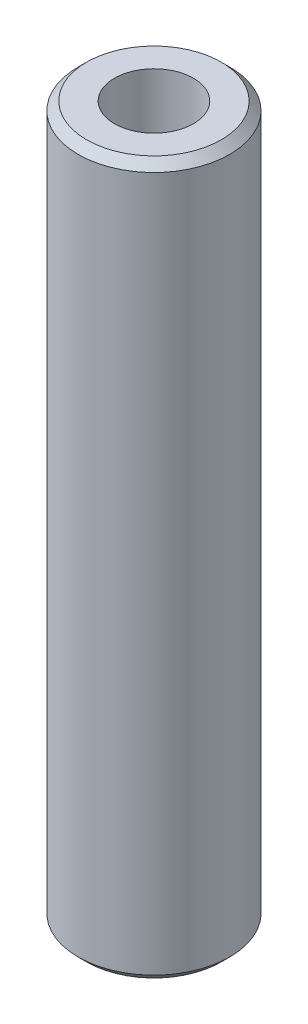
ISO-10303-21;
HEADER;
FILE_DESCRIPTION(('STEP AP214'),'2;1');
FILE_NAME('part.step','',(''),(''),'','','');
FILE_SCHEMA(('AUTOMOTIVE_DESIGN { 1 0 10303 214 1 1 1 1 }'));
ENDSEC;
DATA;
#1=APPLICATION_CONTEXT('core data for automotive mechanical design processes');
#2=APPLICATION_PROTOCOL_DEFINITION('international standard','automotive_design',2000,#1);
#3=PRODUCT_CONTEXT('',#1,'mechanical');
#4=PRODUCT('Part','Part','',(#3));
#5=PRODUCT_RELATED_PRODUCT_CATEGORY('part','',(#4));
#6=PRODUCT_DEFINITION_FORMATION('','',#4);
#7=PRODUCT_DEFINITION_CONTEXT('part definition',#1,'design');
#8=PRODUCT_DEFINITION('design','',#6,#7);
#9=PRODUCT_DEFINITION_SHAPE('','',#8);
#10=(LENGTH_UNIT() NAMED_UNIT(*) SI_UNIT(.MILLI.,.METRE.));
#11=(NAMED_UNIT(*) PLANE_ANGLE_UNIT() SI_UNIT($,.RADIAN.));
#12=(NAMED_UNIT(*) SI_UNIT($,.STERADIAN.) SOLID_ANGLE_UNIT());
#13=UNCERTAINTY_MEASURE_WITH_UNIT(LENGTH_MEASURE(1.E-05),#10,'distance_accuracy_value','');
#14=(GEOMETRIC_REPRESENTATION_CONTEXT(3) GLOBAL_UNCERTAINTY_ASSIGNED_CONTEXT((#13)) GLOBAL_UNIT_ASSIGNED_CONTEXT((#10,
#11,#12)) REPRESENTATION_CONTEXT('',''));
#15=CARTESIAN_POINT('',(0.,0.,0.));
#16=DIRECTION('',(0.,0.,1.));
#17=DIRECTION('',(1.,0.,0.));
#18=AXIS2_PLACEMENT_3D('',#15,#16,#17);
#19=CARTESIAN_POINT('',(0.,399.389153584108,0.));
#20=DIRECTION('',(0.,-1.,0.));
#21=DIRECTION('',(0.,0.,-1.));
#22=AXIS2_PLACEMENT_3D('',#19,#20,#21);
#23=CYLINDRICAL_SURFACE('',#22,42.5);
#24=CARTESIAN_POINT('',(0.,394.657051518276,0.));
#25=DIRECTION('',(0.,1.,0.));
#26=DIRECTION('',(0.,0.,1.));
#27=AXIS2_PLACEMENT_3D('',#24,#25,#26);
#28=CIRCLE('',#27,42.5);
#29=CARTESIAN_POINT('',(0.,394.657051518276,42.5));
#30=VERTEX_POINT('',#29);
#31=EDGE_CURVE('E50',#30,#30,#28,.F.);
#32=ORIENTED_EDGE('',*,*,#31,.T.);
#33=EDGE_LOOP('',(#32));
#34=FACE_BOUND('',#33,.T.);
#35=CARTESIAN_POINT('',(0.,4.73210206583213,0.));
#36=DIRECTION('',(0.,1.,0.));
#37=DIRECTION('',(0.,0.,1.));
#38=AXIS2_PLACEMENT_3D('',#35,#36,#37);
#39=CIRCLE('',#38,42.5);
#40=CARTESIAN_POINT('',(0.,4.73210206583213,42.5));
#41=VERTEX_POINT('',#40);
#42=EDGE_CURVE('E51',#41,#41,#39,.T.);
#43=ORIENTED_EDGE('',*,*,#42,.T.);
#44=EDGE_LOOP('',(#43));
#45=FACE_BOUND('',#44,.T.);
#46=ADVANCED_FACE('F39',(#34,#45),#23,.T.);
#47=CARTESIAN_POINT('',(0.,399.389153584108,0.));
#48=DIRECTION('',(0.,1.,0.));
#49=DIRECTION('',(0.,0.,1.));
#50=AXIS2_PLACEMENT_3D('',#47,#48,#49);
#51=PLANE('',#50);
#52=CARTESIAN_POINT('',(0.,399.389153584108,0.));
#53=DIRECTION('',(0.,1.,0.));
#54=DIRECTION('',(0.,0.,1.));
#55=AXIS2_PLACEMENT_3D('',#52,#53,#54);
#56=CIRCLE('',#55,37.7678979341677);
#57=CARTESIAN_POINT('',(0.,399.389153584108,37.7678979341677));
#58=VERTEX_POINT('',#57);
#59=EDGE_CURVE('E54',#58,#58,#56,.T.);
#60=ORIENTED_EDGE('',*,*,#59,.T.);
#61=EDGE_LOOP('',(#60));
#62=FACE_BOUND('',#61,.T.);
#63=CARTESIAN_POINT('',(0.,399.389153584108,0.));
#64=DIRECTION('',(0.,1.,0.));
#65=DIRECTION('',(0.,0.,1.));
#66=AXIS2_PLACEMENT_3D('',#63,#64,#65);
#67=CIRCLE('',#66,22.1499963429432);
#68=CARTESIAN_POINT('',(0.,399.389153584108,22.1499963429432));
#69=VERTEX_POINT('',#68);
#70=EDGE_CURVE('E58',#69,#69,#67,.T.);
#71=ORIENTED_EDGE('',*,*,#70,.F.);
#72=EDGE_LOOP('',(#71));
#73=FACE_BOUND('',#72,.T.);
#74=ADVANCED_FACE('F69',(#62,#73),#51,.T.);
#75=CARTESIAN_POINT('',(0.,0.,0.));
#76=DIRECTION('',(0.,1.,0.));
#77=DIRECTION('',(0.,0.,1.));
#78=AXIS2_PLACEMENT_3D('',#75,#76,#77);
#79=PLANE('',#78);
#80=CARTESIAN_POINT('',(0.,0.,0.));
#81=DIRECTION('',(0.,1.,0.));
#82=DIRECTION('',(0.,0.,1.));
#83=AXIS2_PLACEMENT_3D('',#80,#81,#82);
#84=CIRCLE('',#83,37.7678979341678);
#85=CARTESIAN_POINT('',(0.,0.,37.7678979341678));
#86=VERTEX_POINT('',#85);
#87=EDGE_CURVE('E10',#86,#86,#84,.F.);
#88=ORIENTED_EDGE('',*,*,#87,.T.);
#89=EDGE_LOOP('',(#88));
#90=FACE_BOUND('',#89,.T.);
#91=CARTESIAN_POINT('',(0.,0.,0.));
#92=DIRECTION('',(0.,1.,0.));
#93=DIRECTION('',(0.,0.,1.));
#94=AXIS2_PLACEMENT_3D('',#91,#92,#93);
#95=CIRCLE('',#94,22.1499963429432);
#96=CARTESIAN_POINT('',(0.,0.,22.1499963429432));
#97=VERTEX_POINT('',#96);
#98=EDGE_CURVE('E63',#97,#97,#95,.T.);
#99=ORIENTED_EDGE('',*,*,#98,.T.);
#100=EDGE_LOOP('',(#99));
#101=FACE_BOUND('',#100,.T.);
#102=ADVANCED_FACE('F75',(#90,#101),#79,.F.);
#103=CARTESIAN_POINT('',(0.,399.389153584108,0.));
#104=DIRECTION('',(0.,-1.,0.));
#105=DIRECTION('',(0.,0.,-1.));
#106=AXIS2_PLACEMENT_3D('',#103,#104,#105);
#107=CYLINDRICAL_SURFACE('',#106,22.1499963429432);
#108=ORIENTED_EDGE('',*,*,#70,.T.);
#109=EDGE_LOOP('',(#108));
#110=FACE_BOUND('',#109,.T.);
#111=ORIENTED_EDGE('',*,*,#98,.F.);
#112=EDGE_LOOP('',(#111));
#113=FACE_BOUND('',#112,.T.);
#114=ADVANCED_FACE('F70',(#110,#113),#107,.F.);
#115=CARTESIAN_POINT('',(0.,399.389153584108,0.));
#116=DIRECTION('',(0.,-1.,0.));
#117=DIRECTION('',(0.,0.,-1.));
#118=AXIS2_PLACEMENT_3D('',#115,#116,#117);
#119=CONICAL_SURFACE('',#118,37.7678979341677,0.785398163397445);
#120=ORIENTED_EDGE('',*,*,#31,.F.);
#121=EDGE_LOOP('',(#120));
#122=FACE_BOUND('',#121,.T.);
#123=ORIENTED_EDGE('',*,*,#59,.F.);
#124=EDGE_LOOP('',(#123));
#125=FACE_BOUND('',#124,.T.);
#126=ADVANCED_FACE('F81',(#122,#125),#119,.T.);
#127=CARTESIAN_POINT('',(0.,4.73210206583213,0.));
#128=DIRECTION('',(0.,1.,0.));
#129=DIRECTION('',(0.,0.,1.));
#130=AXIS2_PLACEMENT_3D('',#127,#128,#129);
#131=CONICAL_SURFACE('',#130,42.5,0.785398163397451);
#132=ORIENTED_EDGE('',*,*,#87,.F.);
#133=EDGE_LOOP('',(#132));
#134=FACE_BOUND('',#133,.T.);
#135=ORIENTED_EDGE('',*,*,#42,.F.);
#136=EDGE_LOOP('',(#135));
#137=FACE_BOUND('',#136,.T.);
#138=ADVANCED_FACE('F45',(#134,#137),#131,.T.);
#139=CLOSED_SHELL('',(#46,#74,#102,#114,#126,#138));
#140=MANIFOLD_SOLID_BREP('B2',#139);
#141=ADVANCED_BREP_SHAPE_REPRESENTATION('',(#18,#140),#14);
#142=SHAPE_DEFINITION_REPRESENTATION(#9,#141);
ENDSEC;
END-ISO-10303-21;
